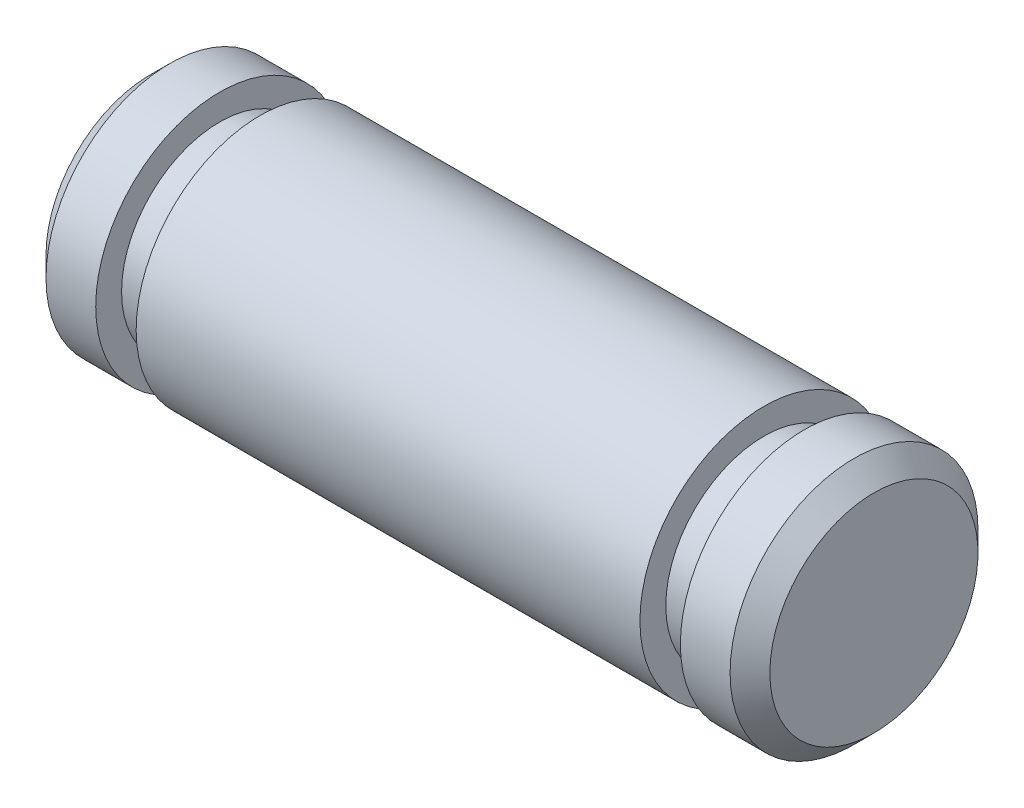
ISO-10303-21;
HEADER;
FILE_DESCRIPTION(('STEP AP214'),'2;1');
FILE_NAME('part.step','',(''),(''),'','','');
FILE_SCHEMA(('AUTOMOTIVE_DESIGN { 1 0 10303 214 1 1 1 1 }'));
ENDSEC;
DATA;
#1=APPLICATION_CONTEXT('core data for automotive mechanical design processes');
#2=APPLICATION_PROTOCOL_DEFINITION('international standard','automotive_design',2000,#1);
#3=PRODUCT_CONTEXT('',#1,'mechanical');
#4=PRODUCT('Part','Part','',(#3));
#5=PRODUCT_RELATED_PRODUCT_CATEGORY('part','',(#4));
#6=PRODUCT_DEFINITION_FORMATION('','',#4);
#7=PRODUCT_DEFINITION_CONTEXT('part definition',#1,'design');
#8=PRODUCT_DEFINITION('design','',#6,#7);
#9=PRODUCT_DEFINITION_SHAPE('','',#8);
#10=(LENGTH_UNIT() NAMED_UNIT(*) SI_UNIT(.MILLI.,.METRE.));
#11=(NAMED_UNIT(*) PLANE_ANGLE_UNIT() SI_UNIT($,.RADIAN.));
#12=(NAMED_UNIT(*) SI_UNIT($,.STERADIAN.) SOLID_ANGLE_UNIT());
#13=UNCERTAINTY_MEASURE_WITH_UNIT(LENGTH_MEASURE(1.E-05),#10,'distance_accuracy_value','');
#14=(GEOMETRIC_REPRESENTATION_CONTEXT(3) GLOBAL_UNCERTAINTY_ASSIGNED_CONTEXT((#13)) GLOBAL_UNIT_ASSIGNED_CONTEXT((#10,
#11,#12)) REPRESENTATION_CONTEXT('',''));
#15=CARTESIAN_POINT('',(0.,0.,0.));
#16=DIRECTION('',(0.,0.,1.));
#17=DIRECTION('',(1.,0.,0.));
#18=AXIS2_PLACEMENT_3D('',#15,#16,#17);
#19=CARTESIAN_POINT('',(-6.9342,0.,0.));
#20=DIRECTION('',(1.,0.,0.));
#21=DIRECTION('',(0.,0.,-1.));
#22=AXIS2_PLACEMENT_3D('',#19,#20,#21);
#23=PLANE('',#22);
#24=CARTESIAN_POINT('',(-6.9342,0.,0.));
#25=DIRECTION('',(-1.,0.,0.));
#26=DIRECTION('',(0.,0.,1.));
#27=AXIS2_PLACEMENT_3D('',#24,#25,#26);
#28=CIRCLE('',#27,1.9939);
#29=CARTESIAN_POINT('',(-6.9342,0.,1.9939));
#30=VERTEX_POINT('',#29);
#31=EDGE_CURVE('E10',#30,#30,#28,.T.);
#32=ORIENTED_EDGE('',*,*,#31,.T.);
#33=EDGE_LOOP('',(#32));
#34=FACE_BOUND('',#33,.T.);
#35=ADVANCED_FACE('F32',(#34),#23,.F.);
#36=CARTESIAN_POINT('',(-6.5532,0.,0.));
#37=DIRECTION('',(1.,0.,0.));
#38=DIRECTION('',(0.,0.,-1.));
#39=AXIS2_PLACEMENT_3D('',#36,#37,#38);
#40=CONICAL_SURFACE('',#39,2.3749,0.785398163397449);
#41=ORIENTED_EDGE('',*,*,#31,.F.);
#42=EDGE_LOOP('',(#41));
#43=FACE_BOUND('',#42,.T.);
#44=CARTESIAN_POINT('',(-6.5532,0.,0.));
#45=DIRECTION('',(-1.,0.,0.));
#46=DIRECTION('',(0.,0.,1.));
#47=AXIS2_PLACEMENT_3D('',#44,#45,#46);
#48=CIRCLE('',#47,2.3749);
#49=CARTESIAN_POINT('',(-6.5532,0.,2.3749));
#50=VERTEX_POINT('',#49);
#51=EDGE_CURVE('E38',#50,#50,#48,.T.);
#52=ORIENTED_EDGE('',*,*,#51,.T.);
#53=EDGE_LOOP('',(#52));
#54=FACE_BOUND('',#53,.T.);
#55=ADVANCED_FACE('F88',(#43,#54),#40,.T.);
#56=CARTESIAN_POINT('',(6.9342,0.,0.));
#57=DIRECTION('',(-1.,0.,0.));
#58=DIRECTION('',(0.,0.,1.));
#59=AXIS2_PLACEMENT_3D('',#56,#57,#58);
#60=CYLINDRICAL_SURFACE('',#59,2.3749);
#61=ORIENTED_EDGE('',*,*,#51,.F.);
#62=EDGE_LOOP('',(#61));
#63=FACE_BOUND('',#62,.T.);
#64=CARTESIAN_POINT('',(-5.6007,0.,0.));
#65=DIRECTION('',(-1.,0.,0.));
#66=DIRECTION('',(0.,0.,1.));
#67=AXIS2_PLACEMENT_3D('',#64,#65,#66);
#68=CIRCLE('',#67,2.3749);
#69=CARTESIAN_POINT('',(-5.6007,0.,2.3749));
#70=VERTEX_POINT('',#69);
#71=EDGE_CURVE('E42',#70,#70,#68,.T.);
#72=ORIENTED_EDGE('',*,*,#71,.T.);
#73=EDGE_LOOP('',(#72));
#74=FACE_BOUND('',#73,.T.);
#75=ADVANCED_FACE('F92',(#63,#74),#60,.T.);
#76=CARTESIAN_POINT('',(-5.6007,2.3749,0.));
#77=DIRECTION('',(-1.,0.,0.));
#78=DIRECTION('',(0.,0.,1.));
#79=AXIS2_PLACEMENT_3D('',#76,#77,#78);
#80=PLANE('',#79);
#81=ORIENTED_EDGE('',*,*,#71,.F.);
#82=EDGE_LOOP('',(#81));
#83=FACE_BOUND('',#82,.T.);
#84=CARTESIAN_POINT('',(-5.6007,0.,0.));
#85=DIRECTION('',(-1.,0.,0.));
#86=DIRECTION('',(0.,0.,1.));
#87=AXIS2_PLACEMENT_3D('',#84,#85,#86);
#88=CIRCLE('',#87,1.8796);
#89=CARTESIAN_POINT('',(-5.6007,0.,1.8796));
#90=VERTEX_POINT('',#89);
#91=EDGE_CURVE('E46',#90,#90,#88,.T.);
#92=ORIENTED_EDGE('',*,*,#91,.T.);
#93=EDGE_LOOP('',(#92));
#94=FACE_BOUND('',#93,.T.);
#95=ADVANCED_FACE('F97',(#83,#94),#80,.F.);
#96=CARTESIAN_POINT('',(6.9342,0.,0.));
#97=DIRECTION('',(-1.,0.,0.));
#98=DIRECTION('',(0.,0.,1.));
#99=AXIS2_PLACEMENT_3D('',#96,#97,#98);
#100=CYLINDRICAL_SURFACE('',#99,1.8796);
#101=ORIENTED_EDGE('',*,*,#91,.F.);
#102=EDGE_LOOP('',(#101));
#103=FACE_BOUND('',#102,.T.);
#104=CARTESIAN_POINT('',(-4.826,0.,0.));
#105=DIRECTION('',(-1.,0.,0.));
#106=DIRECTION('',(0.,0.,1.));
#107=AXIS2_PLACEMENT_3D('',#104,#105,#106);
#108=CIRCLE('',#107,1.8796);
#109=CARTESIAN_POINT('',(-4.826,0.,1.8796));
#110=VERTEX_POINT('',#109);
#111=EDGE_CURVE('E51',#110,#110,#108,.T.);
#112=ORIENTED_EDGE('',*,*,#111,.T.);
#113=EDGE_LOOP('',(#112));
#114=FACE_BOUND('',#113,.T.);
#115=ADVANCED_FACE('F103',(#103,#114),#100,.T.);
#116=CARTESIAN_POINT('',(-4.826,1.8796,0.));
#117=DIRECTION('',(1.,0.,0.));
#118=DIRECTION('',(0.,0.,-1.));
#119=AXIS2_PLACEMENT_3D('',#116,#117,#118);
#120=PLANE('',#119);
#121=ORIENTED_EDGE('',*,*,#111,.F.);
#122=EDGE_LOOP('',(#121));
#123=FACE_BOUND('',#122,.T.);
#124=CARTESIAN_POINT('',(-4.826,0.,0.));
#125=DIRECTION('',(-1.,0.,0.));
#126=DIRECTION('',(0.,0.,1.));
#127=AXIS2_PLACEMENT_3D('',#124,#125,#126);
#128=CIRCLE('',#127,2.3749);
#129=CARTESIAN_POINT('',(-4.826,0.,2.3749));
#130=VERTEX_POINT('',#129);
#131=EDGE_CURVE('E54',#130,#130,#128,.T.);
#132=ORIENTED_EDGE('',*,*,#131,.T.);
#133=EDGE_LOOP('',(#132));
#134=FACE_BOUND('',#133,.T.);
#135=ADVANCED_FACE('F107',(#123,#134),#120,.F.);
#136=CARTESIAN_POINT('',(6.9342,0.,0.));
#137=DIRECTION('',(-1.,0.,0.));
#138=DIRECTION('',(0.,0.,1.));
#139=AXIS2_PLACEMENT_3D('',#136,#137,#138);
#140=CYLINDRICAL_SURFACE('',#139,2.3749);
#141=ORIENTED_EDGE('',*,*,#131,.F.);
#142=EDGE_LOOP('',(#141));
#143=FACE_BOUND('',#142,.T.);
#144=CARTESIAN_POINT('',(4.826,0.,0.));
#145=DIRECTION('',(-1.,0.,0.));
#146=DIRECTION('',(0.,0.,1.));
#147=AXIS2_PLACEMENT_3D('',#144,#145,#146);
#148=CIRCLE('',#147,2.3749);
#149=CARTESIAN_POINT('',(4.826,0.,2.3749));
#150=VERTEX_POINT('',#149);
#151=EDGE_CURVE('E57',#150,#150,#148,.T.);
#152=ORIENTED_EDGE('',*,*,#151,.T.);
#153=EDGE_LOOP('',(#152));
#154=FACE_BOUND('',#153,.T.);
#155=ADVANCED_FACE('F111',(#143,#154),#140,.T.);
#156=CARTESIAN_POINT('',(4.826,2.3749,0.));
#157=DIRECTION('',(-1.,0.,0.));
#158=DIRECTION('',(0.,0.,1.));
#159=AXIS2_PLACEMENT_3D('',#156,#157,#158);
#160=PLANE('',#159);
#161=ORIENTED_EDGE('',*,*,#151,.F.);
#162=EDGE_LOOP('',(#161));
#163=FACE_BOUND('',#162,.T.);
#164=CARTESIAN_POINT('',(4.826,0.,0.));
#165=DIRECTION('',(-1.,0.,0.));
#166=DIRECTION('',(0.,0.,1.));
#167=AXIS2_PLACEMENT_3D('',#164,#165,#166);
#168=CIRCLE('',#167,1.8796);
#169=CARTESIAN_POINT('',(4.826,0.,1.8796));
#170=VERTEX_POINT('',#169);
#171=EDGE_CURVE('E60',#170,#170,#168,.T.);
#172=ORIENTED_EDGE('',*,*,#171,.T.);
#173=EDGE_LOOP('',(#172));
#174=FACE_BOUND('',#173,.T.);
#175=ADVANCED_FACE('F115',(#163,#174),#160,.F.);
#176=CARTESIAN_POINT('',(6.9342,0.,0.));
#177=DIRECTION('',(-1.,0.,0.));
#178=DIRECTION('',(0.,0.,1.));
#179=AXIS2_PLACEMENT_3D('',#176,#177,#178);
#180=CYLINDRICAL_SURFACE('',#179,1.8796);
#181=ORIENTED_EDGE('',*,*,#171,.F.);
#182=EDGE_LOOP('',(#181));
#183=FACE_BOUND('',#182,.T.);
#184=CARTESIAN_POINT('',(5.6007,0.,0.));
#185=DIRECTION('',(-1.,0.,0.));
#186=DIRECTION('',(0.,0.,1.));
#187=AXIS2_PLACEMENT_3D('',#184,#185,#186);
#188=CIRCLE('',#187,1.8796);
#189=CARTESIAN_POINT('',(5.6007,0.,1.8796));
#190=VERTEX_POINT('',#189);
#191=EDGE_CURVE('E63',#190,#190,#188,.T.);
#192=ORIENTED_EDGE('',*,*,#191,.T.);
#193=EDGE_LOOP('',(#192));
#194=FACE_BOUND('',#193,.T.);
#195=ADVANCED_FACE('F119',(#183,#194),#180,.T.);
#196=CARTESIAN_POINT('',(5.6007,1.8796,0.));
#197=DIRECTION('',(1.,0.,0.));
#198=DIRECTION('',(0.,0.,-1.));
#199=AXIS2_PLACEMENT_3D('',#196,#197,#198);
#200=PLANE('',#199);
#201=ORIENTED_EDGE('',*,*,#191,.F.);
#202=EDGE_LOOP('',(#201));
#203=FACE_BOUND('',#202,.T.);
#204=CARTESIAN_POINT('',(5.6007,0.,0.));
#205=DIRECTION('',(-1.,0.,0.));
#206=DIRECTION('',(0.,0.,1.));
#207=AXIS2_PLACEMENT_3D('',#204,#205,#206);
#208=CIRCLE('',#207,2.3749);
#209=CARTESIAN_POINT('',(5.6007,0.,2.3749));
#210=VERTEX_POINT('',#209);
#211=EDGE_CURVE('E66',#210,#210,#208,.T.);
#212=ORIENTED_EDGE('',*,*,#211,.T.);
#213=EDGE_LOOP('',(#212));
#214=FACE_BOUND('',#213,.T.);
#215=ADVANCED_FACE('F123',(#203,#214),#200,.F.);
#216=CARTESIAN_POINT('',(6.9342,0.,0.));
#217=DIRECTION('',(-1.,0.,0.));
#218=DIRECTION('',(0.,0.,1.));
#219=AXIS2_PLACEMENT_3D('',#216,#217,#218);
#220=CYLINDRICAL_SURFACE('',#219,2.3749);
#221=ORIENTED_EDGE('',*,*,#211,.F.);
#222=EDGE_LOOP('',(#221));
#223=FACE_BOUND('',#222,.T.);
#224=CARTESIAN_POINT('',(6.5532,0.,0.));
#225=DIRECTION('',(-1.,0.,0.));
#226=DIRECTION('',(0.,0.,1.));
#227=AXIS2_PLACEMENT_3D('',#224,#225,#226);
#228=CIRCLE('',#227,2.3749);
#229=CARTESIAN_POINT('',(6.5532,0.,2.3749));
#230=VERTEX_POINT('',#229);
#231=EDGE_CURVE('E69',#230,#230,#228,.T.);
#232=ORIENTED_EDGE('',*,*,#231,.T.);
#233=EDGE_LOOP('',(#232));
#234=FACE_BOUND('',#233,.T.);
#235=ADVANCED_FACE('F84',(#223,#234),#220,.T.);
#236=CARTESIAN_POINT('',(6.9342,0.,0.));
#237=DIRECTION('',(-1.,0.,0.));
#238=DIRECTION('',(0.,0.,1.));
#239=AXIS2_PLACEMENT_3D('',#236,#237,#238);
#240=CONICAL_SURFACE('',#239,1.9939,0.785398163397449);
#241=ORIENTED_EDGE('',*,*,#231,.F.);
#242=EDGE_LOOP('',(#241));
#243=FACE_BOUND('',#242,.T.);
#244=CARTESIAN_POINT('',(6.9342,0.,0.));
#245=DIRECTION('',(-1.,0.,0.));
#246=DIRECTION('',(0.,0.,1.));
#247=AXIS2_PLACEMENT_3D('',#244,#245,#246);
#248=CIRCLE('',#247,1.9939);
#249=CARTESIAN_POINT('',(6.9342,0.,1.9939));
#250=VERTEX_POINT('',#249);
#251=EDGE_CURVE('E72',#250,#250,#248,.T.);
#252=ORIENTED_EDGE('',*,*,#251,.T.);
#253=EDGE_LOOP('',(#252));
#254=FACE_BOUND('',#253,.T.);
#255=ADVANCED_FACE('F76',(#243,#254),#240,.T.);
#256=CARTESIAN_POINT('',(6.9342,1.9939,0.));
#257=DIRECTION('',(-1.,0.,0.));
#258=DIRECTION('',(0.,0.,1.));
#259=AXIS2_PLACEMENT_3D('',#256,#257,#258);
#260=PLANE('',#259);
#261=ORIENTED_EDGE('',*,*,#251,.F.);
#262=EDGE_LOOP('',(#261));
#263=FACE_BOUND('',#262,.T.);
#264=ADVANCED_FACE('F78',(#263),#260,.F.);
#265=CLOSED_SHELL('',(#35,#55,#75,#95,#115,#135,#155,#175,#195,#215,#235,#255,#264));
#266=MANIFOLD_SOLID_BREP('B2',#265);
#267=ADVANCED_BREP_SHAPE_REPRESENTATION('',(#18,#266),#14);
#268=SHAPE_DEFINITION_REPRESENTATION(#9,#267);
ENDSEC;
END-ISO-10303-21;
